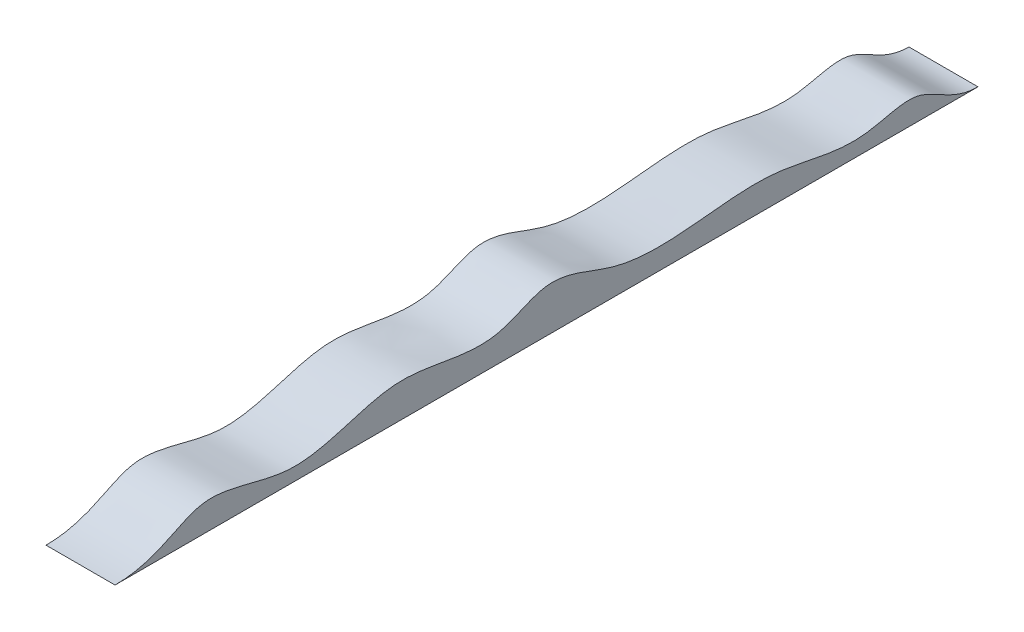
ISO-10303-21;
HEADER;
FILE_DESCRIPTION(('STEP AP214'),'2;1');
FILE_NAME('part.step','',(''),(''),'','','');
FILE_SCHEMA(('AUTOMOTIVE_DESIGN { 1 0 10303 214 1 1 1 1 }'));
ENDSEC;
DATA;
#1=APPLICATION_CONTEXT('core data for automotive mechanical design processes');
#2=APPLICATION_PROTOCOL_DEFINITION('international standard','automotive_design',2000,#1);
#3=PRODUCT_CONTEXT('',#1,'mechanical');
#4=PRODUCT('Part','Part','',(#3));
#5=PRODUCT_RELATED_PRODUCT_CATEGORY('part','',(#4));
#6=PRODUCT_DEFINITION_FORMATION('','',#4);
#7=PRODUCT_DEFINITION_CONTEXT('part definition',#1,'design');
#8=PRODUCT_DEFINITION('design','',#6,#7);
#9=PRODUCT_DEFINITION_SHAPE('','',#8);
#10=(LENGTH_UNIT() NAMED_UNIT(*) SI_UNIT(.MILLI.,.METRE.));
#11=(NAMED_UNIT(*) PLANE_ANGLE_UNIT() SI_UNIT($,.RADIAN.));
#12=(NAMED_UNIT(*) SI_UNIT($,.STERADIAN.) SOLID_ANGLE_UNIT());
#13=UNCERTAINTY_MEASURE_WITH_UNIT(LENGTH_MEASURE(1.E-05),#10,'distance_accuracy_value','');
#14=(GEOMETRIC_REPRESENTATION_CONTEXT(3) GLOBAL_UNCERTAINTY_ASSIGNED_CONTEXT((#13)) GLOBAL_UNIT_ASSIGNED_CONTEXT((#10,
#11,#12)) REPRESENTATION_CONTEXT('',''));
#15=CARTESIAN_POINT('',(0.,0.,0.));
#16=DIRECTION('',(0.,0.,1.));
#17=DIRECTION('',(1.,0.,0.));
#18=AXIS2_PLACEMENT_3D('',#15,#16,#17);
#19=CARTESIAN_POINT('',(80.,0.,-2000.));
#20=CARTESIAN_POINT('',(80.,0.,-1936.76813183182));
#21=CARTESIAN_POINT('',(80.,78.6314528987854,-1874.79357759139));
#22=CARTESIAN_POINT('',(80.,13.14727752879,-1707.18300380861));
#23=CARTESIAN_POINT('',(80.,82.0456130076924,-1528.57751812862));
#24=CARTESIAN_POINT('',(80.,45.2602091860645,-1329.44390291729));
#25=CARTESIAN_POINT('',(80.,48.6989699740136,-1150.2026038396));
#26=CARTESIAN_POINT('',(80.,126.612269656816,-1013.57996229964));
#27=CARTESIAN_POINT('',(80.,26.1160382276299,-857.965641256137));
#28=CARTESIAN_POINT('',(80.,121.07829290568,-648.483362672638));
#29=CARTESIAN_POINT('',(80.,-12.1711829242411,-431.950874980048));
#30=CARTESIAN_POINT('',(80.,107.255043870688,-187.789239925543));
#31=CARTESIAN_POINT('',(80.,0.,-103.708782767741));
#32=CARTESIAN_POINT('',(80.,0.,0.));
#33=B_SPLINE_CURVE_WITH_KNOTS('',3,(#19,#20,#21,#22,#23,#24,#25,#26,#27,#28,#29,#30,#31,#32),
.UNSPECIFIED.,.F.,.F.,(4,1,1,1,1,1,1,1,1,1,1,4),(0.,0.0757634189540728,0.131167357194234,
0.234849578853277,0.346429595707999,0.422200257375589,0.498574988742085,0.552158589359824,
0.669428167182608,0.794216051483329,0.8925931686826,1.),.UNSPECIFIED.);
#34=DIRECTION('',(-1.,0.,0.));
#35=VECTOR('',#34,1.);
#36=SURFACE_OF_LINEAR_EXTRUSION('',#33,#35);
#37=CARTESIAN_POINT('',(-80.,0.,-2000.));
#38=CARTESIAN_POINT('',(-80.,0.,-1936.76813183182));
#39=CARTESIAN_POINT('',(-80.,78.6314528987854,-1874.79357759139));
#40=CARTESIAN_POINT('',(-80.,13.14727752879,-1707.18300380861));
#41=CARTESIAN_POINT('',(-80.,82.0456130076924,-1528.57751812862));
#42=CARTESIAN_POINT('',(-80.,45.2602091860645,-1329.44390291729));
#43=CARTESIAN_POINT('',(-80.,48.6989699740136,-1150.2026038396));
#44=CARTESIAN_POINT('',(-80.,126.612269656816,-1013.57996229964));
#45=CARTESIAN_POINT('',(-80.,26.1160382276299,-857.965641256137));
#46=CARTESIAN_POINT('',(-80.,121.07829290568,-648.483362672638));
#47=CARTESIAN_POINT('',(-80.,-12.1711829242411,-431.950874980048));
#48=CARTESIAN_POINT('',(-80.,107.255043870688,-187.789239925543));
#49=CARTESIAN_POINT('',(-80.,0.,-103.708782767741));
#50=CARTESIAN_POINT('',(-80.,0.,0.));
#51=B_SPLINE_CURVE_WITH_KNOTS('',3,(#37,#38,#39,#40,#41,#42,#43,#44,#45,#46,#47,#48,#49,#50),
.UNSPECIFIED.,.F.,.F.,(4,1,1,1,1,1,1,1,1,1,1,4),(0.,0.0757634189540728,0.131167357194234,
0.234849578853277,0.346429595707999,0.422200257375589,0.498574988742085,0.552158589359824,
0.669428167182608,0.794216051483329,0.8925931686826,1.),.UNSPECIFIED.);
#52=CARTESIAN_POINT('',(-80.,0.,-2000.));
#53=VERTEX_POINT('',#52);
#54=CARTESIAN_POINT('',(-80.,0.,0.));
#55=VERTEX_POINT('',#54);
#56=EDGE_CURVE('E67',#53,#55,#51,.T.);
#57=ORIENTED_EDGE('',*,*,#56,.T.);
#58=DIRECTION('',(-1.,0.,0.));
#59=VECTOR('',#58,1.);
#60=CARTESIAN_POINT('',(80.,0.,0.));
#61=LINE('',#60,#59);
#62=CARTESIAN_POINT('',(80.,0.,0.));
#63=VERTEX_POINT('',#62);
#64=EDGE_CURVE('E11',#63,#55,#61,.T.);
#65=ORIENTED_EDGE('',*,*,#64,.F.);
#66=CARTESIAN_POINT('',(80.,0.,-2000.));
#67=VERTEX_POINT('',#66);
#68=EDGE_CURVE('E66',#67,#63,#33,.T.);
#69=ORIENTED_EDGE('',*,*,#68,.F.);
#70=DIRECTION('',(-1.,0.,0.));
#71=VECTOR('',#70,1.);
#72=CARTESIAN_POINT('',(80.,0.,-2000.));
#73=LINE('',#72,#71);
#74=EDGE_CURVE('E44',#67,#53,#73,.T.);
#75=ORIENTED_EDGE('',*,*,#74,.T.);
#76=EDGE_LOOP('',(#57,#65,#69,#75));
#77=FACE_BOUND('',#76,.T.);
#78=ADVANCED_FACE('F35',(#77),#36,.F.);
#79=CARTESIAN_POINT('',(80.,0.,0.));
#80=DIRECTION('',(0.,1.,0.));
#81=DIRECTION('',(0.,0.,1.));
#82=AXIS2_PLACEMENT_3D('',#79,#80,#81);
#83=PLANE('',#82);
#84=DIRECTION('',(0.,0.,-1.));
#85=VECTOR('',#84,1.);
#86=CARTESIAN_POINT('',(-80.,0.,0.));
#87=LINE('',#86,#85);
#88=EDGE_CURVE('E59',#55,#53,#87,.T.);
#89=ORIENTED_EDGE('',*,*,#88,.T.);
#90=ORIENTED_EDGE('',*,*,#74,.F.);
#91=DIRECTION('',(0.,0.,-1.));
#92=VECTOR('',#91,1.);
#93=CARTESIAN_POINT('',(80.,0.,0.));
#94=LINE('',#93,#92);
#95=EDGE_CURVE('E51',#63,#67,#94,.T.);
#96=ORIENTED_EDGE('',*,*,#95,.F.);
#97=ORIENTED_EDGE('',*,*,#64,.T.);
#98=EDGE_LOOP('',(#89,#90,#96,#97));
#99=FACE_BOUND('',#98,.T.);
#100=ADVANCED_FACE('F62',(#99),#83,.F.);
#101=CARTESIAN_POINT('',(80.,99.6100353877871,-997.249639411857));
#102=DIRECTION('',(-1.,0.,0.));
#103=DIRECTION('',(0.,0.,1.));
#104=AXIS2_PLACEMENT_3D('',#101,#102,#103);
#105=PLANE('',#104);
#106=ORIENTED_EDGE('',*,*,#68,.T.);
#107=ORIENTED_EDGE('',*,*,#95,.T.);
#108=EDGE_LOOP('',(#106,#107));
#109=FACE_BOUND('',#108,.T.);
#110=ADVANCED_FACE('F84',(#109),#105,.F.);
#111=CARTESIAN_POINT('',(-80.,99.6100353877871,-997.249639411857));
#112=DIRECTION('',(-1.,0.,0.));
#113=DIRECTION('',(0.,0.,1.));
#114=AXIS2_PLACEMENT_3D('',#111,#112,#113);
#115=PLANE('',#114);
#116=ORIENTED_EDGE('',*,*,#56,.F.);
#117=ORIENTED_EDGE('',*,*,#88,.F.);
#118=EDGE_LOOP('',(#116,#117));
#119=FACE_BOUND('',#118,.T.);
#120=ADVANCED_FACE('F70',(#119),#115,.T.);
#121=CLOSED_SHELL('',(#78,#100,#110,#120));
#122=MANIFOLD_SOLID_BREP('B2',#121);
#123=ADVANCED_BREP_SHAPE_REPRESENTATION('',(#18,#122),#14);
#124=SHAPE_DEFINITION_REPRESENTATION(#9,#123);
ENDSEC;
END-ISO-10303-21;
